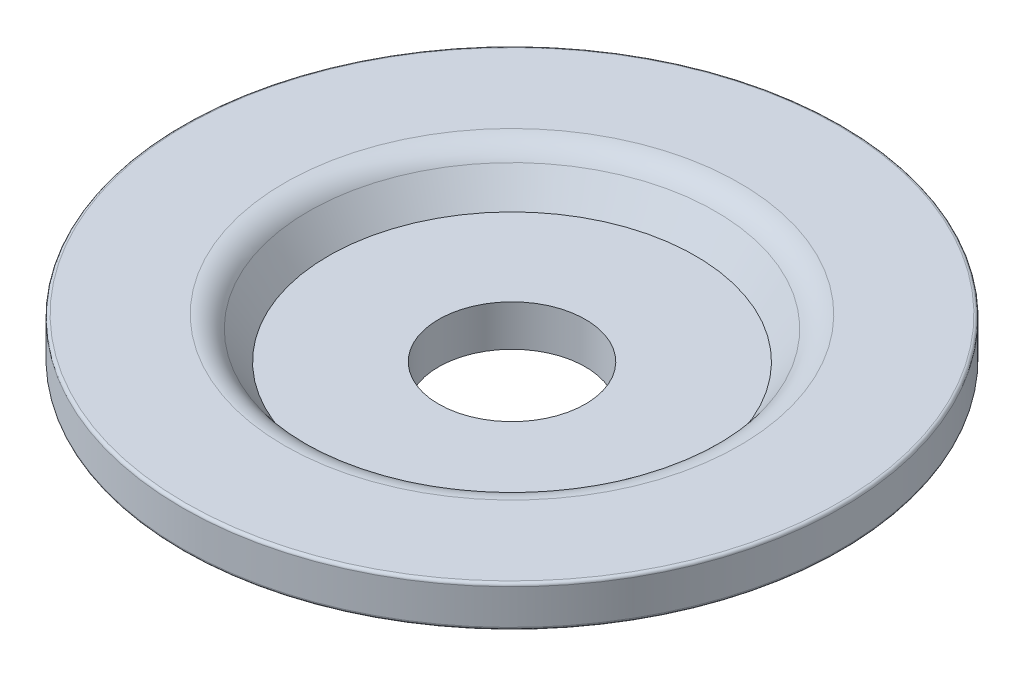
ISO-10303-21;
HEADER;
FILE_DESCRIPTION(('STEP AP214'),'2;1');
FILE_NAME('part.step','',(''),(''),'','','');
FILE_SCHEMA(('AUTOMOTIVE_DESIGN { 1 0 10303 214 1 1 1 1 }'));
ENDSEC;
DATA;
#1=APPLICATION_CONTEXT('core data for automotive mechanical design processes');
#2=APPLICATION_PROTOCOL_DEFINITION('international standard','automotive_design',2000,#1);
#3=PRODUCT_CONTEXT('',#1,'mechanical');
#4=PRODUCT('Part','Part','',(#3));
#5=PRODUCT_RELATED_PRODUCT_CATEGORY('part','',(#4));
#6=PRODUCT_DEFINITION_FORMATION('','',#4);
#7=PRODUCT_DEFINITION_CONTEXT('part definition',#1,'design');
#8=PRODUCT_DEFINITION('design','',#6,#7);
#9=PRODUCT_DEFINITION_SHAPE('','',#8);
#10=(LENGTH_UNIT() NAMED_UNIT(*) SI_UNIT(.MILLI.,.METRE.));
#11=(NAMED_UNIT(*) PLANE_ANGLE_UNIT() SI_UNIT($,.RADIAN.));
#12=(NAMED_UNIT(*) SI_UNIT($,.STERADIAN.) SOLID_ANGLE_UNIT());
#13=UNCERTAINTY_MEASURE_WITH_UNIT(LENGTH_MEASURE(1.E-05),#10,'distance_accuracy_value','');
#14=(GEOMETRIC_REPRESENTATION_CONTEXT(3) GLOBAL_UNCERTAINTY_ASSIGNED_CONTEXT((#13)) GLOBAL_UNIT_ASSIGNED_CONTEXT((#10,
#11,#12)) REPRESENTATION_CONTEXT('',''));
#15=CARTESIAN_POINT('',(0.,0.,0.));
#16=DIRECTION('',(0.,0.,1.));
#17=DIRECTION('',(1.,0.,0.));
#18=AXIS2_PLACEMENT_3D('',#15,#16,#17);
#19=CARTESIAN_POINT('',(0.,0.973091831143438,0.));
#20=DIRECTION('',(0.,1.,0.));
#21=DIRECTION('',(0.,0.,1.));
#22=AXIS2_PLACEMENT_3D('',#19,#20,#21);
#23=CONICAL_SURFACE('',#22,6.93050884502841,0.610273766920193);
#24=CARTESIAN_POINT('',(0.,0.,0.));
#25=DIRECTION('',(0.,1.,0.));
#26=DIRECTION('',(0.,0.,1.));
#27=AXIS2_PLACEMENT_3D('',#24,#25,#26);
#28=CIRCLE('',#27,6.25);
#29=CARTESIAN_POINT('',(0.,0.,6.25));
#30=VERTEX_POINT('',#29);
#31=EDGE_CURVE('E74',#30,#30,#28,.T.);
#32=ORIENTED_EDGE('',*,*,#31,.F.);
#33=EDGE_LOOP('',(#32));
#34=FACE_BOUND('',#33,.T.);
#35=CARTESIAN_POINT('',(0.,0.973091831143438,0.));
#36=DIRECTION('',(0.,1.,0.));
#37=DIRECTION('',(0.,0.,1.));
#38=AXIS2_PLACEMENT_3D('',#35,#36,#37);
#39=CIRCLE('',#38,6.93050884502841);
#40=CARTESIAN_POINT('',(0.,0.973091831143438,6.93050884502841));
#41=VERTEX_POINT('',#40);
#42=EDGE_CURVE('E10',#41,#41,#39,.T.);
#43=ORIENTED_EDGE('',*,*,#42,.T.);
#44=EDGE_LOOP('',(#43));
#45=FACE_BOUND('',#44,.T.);
#46=ADVANCED_FACE('F34',(#34,#45),#23,.F.);
#47=CARTESIAN_POINT('',(0.,0.4,0.));
#48=DIRECTION('',(0.,1.,0.));
#49=DIRECTION('',(0.,0.,1.));
#50=AXIS2_PLACEMENT_3D('',#47,#48,#49);
#51=TOROIDAL_SURFACE('',#50,7.74999999999999,0.999999999999999);
#52=ORIENTED_EDGE('',*,*,#42,.F.);
#53=EDGE_LOOP('',(#52));
#54=FACE_BOUND('',#53,.T.);
#55=CARTESIAN_POINT('',(0.,1.4,0.));
#56=DIRECTION('',(0.,1.,0.));
#57=DIRECTION('',(0.,0.,1.));
#58=AXIS2_PLACEMENT_3D('',#55,#56,#57);
#59=CIRCLE('',#58,7.74999999999999);
#60=CARTESIAN_POINT('',(0.,1.4,7.74999999999999));
#61=VERTEX_POINT('',#60);
#62=EDGE_CURVE('E40',#61,#61,#59,.T.);
#63=ORIENTED_EDGE('',*,*,#62,.T.);
#64=EDGE_LOOP('',(#63));
#65=FACE_BOUND('',#64,.T.);
#66=ADVANCED_FACE('F81',(#54,#65),#51,.T.);
#67=CARTESIAN_POINT('',(7.74999999999999,1.4,0.));
#68=DIRECTION('',(0.,-1.,0.));
#69=DIRECTION('',(0.,0.,-1.));
#70=AXIS2_PLACEMENT_3D('',#67,#68,#69);
#71=PLANE('',#70);
#72=ORIENTED_EDGE('',*,*,#62,.F.);
#73=EDGE_LOOP('',(#72));
#74=FACE_BOUND('',#73,.T.);
#75=CARTESIAN_POINT('',(0.,1.4,0.));
#76=DIRECTION('',(0.,1.,0.));
#77=DIRECTION('',(0.,0.,1.));
#78=AXIS2_PLACEMENT_3D('',#75,#76,#77);
#79=CIRCLE('',#78,11.125);
#80=CARTESIAN_POINT('',(0.,1.4,11.125));
#81=VERTEX_POINT('',#80);
#82=EDGE_CURVE('E44',#81,#81,#79,.T.);
#83=ORIENTED_EDGE('',*,*,#82,.T.);
#84=EDGE_LOOP('',(#83));
#85=FACE_BOUND('',#84,.T.);
#86=ADVANCED_FACE('F85',(#74,#85),#71,.F.);
#87=CARTESIAN_POINT('',(0.,1.3,0.));
#88=DIRECTION('',(0.,1.,0.));
#89=DIRECTION('',(0.,0.,1.));
#90=AXIS2_PLACEMENT_3D('',#87,#88,#89);
#91=TOROIDAL_SURFACE('',#90,11.125,0.0999999999999996);
#92=ORIENTED_EDGE('',*,*,#82,.F.);
#93=EDGE_LOOP('',(#92));
#94=FACE_BOUND('',#93,.T.);
#95=CARTESIAN_POINT('',(0.,1.3,0.));
#96=DIRECTION('',(0.,1.,0.));
#97=DIRECTION('',(0.,0.,1.));
#98=AXIS2_PLACEMENT_3D('',#95,#96,#97);
#99=CIRCLE('',#98,11.225);
#100=CARTESIAN_POINT('',(0.,1.3,11.225));
#101=VERTEX_POINT('',#100);
#102=EDGE_CURVE('E48',#101,#101,#99,.T.);
#103=ORIENTED_EDGE('',*,*,#102,.T.);
#104=EDGE_LOOP('',(#103));
#105=FACE_BOUND('',#104,.T.);
#106=ADVANCED_FACE('F90',(#94,#105),#91,.T.);
#107=CARTESIAN_POINT('',(0.,11.5390643922792,0.));
#108=DIRECTION('',(0.,1.,0.));
#109=DIRECTION('',(0.,0.,1.));
#110=AXIS2_PLACEMENT_3D('',#107,#108,#109);
#111=CYLINDRICAL_SURFACE('',#110,11.225);
#112=ORIENTED_EDGE('',*,*,#102,.F.);
#113=EDGE_LOOP('',(#112));
#114=FACE_BOUND('',#113,.T.);
#115=CARTESIAN_POINT('',(0.,0.0999999999999994,0.));
#116=DIRECTION('',(0.,1.,0.));
#117=DIRECTION('',(0.,0.,1.));
#118=AXIS2_PLACEMENT_3D('',#115,#116,#117);
#119=CIRCLE('',#118,11.225);
#120=CARTESIAN_POINT('',(0.,0.0999999999999994,11.225));
#121=VERTEX_POINT('',#120);
#122=EDGE_CURVE('E53',#121,#121,#119,.T.);
#123=ORIENTED_EDGE('',*,*,#122,.T.);
#124=EDGE_LOOP('',(#123));
#125=FACE_BOUND('',#124,.T.);
#126=ADVANCED_FACE('F96',(#114,#125),#111,.T.);
#127=CARTESIAN_POINT('',(0.,0.1,0.));
#128=DIRECTION('',(0.,1.,0.));
#129=DIRECTION('',(0.,0.,1.));
#130=AXIS2_PLACEMENT_3D('',#127,#128,#129);
#131=TOROIDAL_SURFACE('',#130,11.125,0.0999999999999988);
#132=ORIENTED_EDGE('',*,*,#122,.F.);
#133=EDGE_LOOP('',(#132));
#134=FACE_BOUND('',#133,.T.);
#135=CARTESIAN_POINT('',(0.,0.,0.));
#136=DIRECTION('',(0.,1.,0.));
#137=DIRECTION('',(0.,0.,1.));
#138=AXIS2_PLACEMENT_3D('',#135,#136,#137);
#139=CIRCLE('',#138,11.125);
#140=CARTESIAN_POINT('',(0.,0.,11.125));
#141=VERTEX_POINT('',#140);
#142=EDGE_CURVE('E56',#141,#141,#139,.T.);
#143=ORIENTED_EDGE('',*,*,#142,.T.);
#144=EDGE_LOOP('',(#143));
#145=FACE_BOUND('',#144,.T.);
#146=ADVANCED_FACE('F100',(#134,#145),#131,.T.);
#147=CARTESIAN_POINT('',(7.95837719419747,0.,0.));
#148=DIRECTION('',(0.,1.,0.));
#149=DIRECTION('',(0.,0.,1.));
#150=AXIS2_PLACEMENT_3D('',#147,#148,#149);
#151=PLANE('',#150);
#152=ORIENTED_EDGE('',*,*,#142,.F.);
#153=EDGE_LOOP('',(#152));
#154=FACE_BOUND('',#153,.T.);
#155=CARTESIAN_POINT('',(0.,0.,0.));
#156=DIRECTION('',(0.,1.,0.));
#157=DIRECTION('',(0.,0.,1.));
#158=AXIS2_PLACEMENT_3D('',#155,#156,#157);
#159=CIRCLE('',#158,7.95837719419747);
#160=CARTESIAN_POINT('',(0.,0.,7.95837719419747));
#161=VERTEX_POINT('',#160);
#162=EDGE_CURVE('E59',#161,#161,#159,.T.);
#163=ORIENTED_EDGE('',*,*,#162,.T.);
#164=EDGE_LOOP('',(#163));
#165=FACE_BOUND('',#164,.T.);
#166=ADVANCED_FACE('F104',(#154,#165),#151,.F.);
#167=CARTESIAN_POINT('',(0.,-0.759637746715157,0.));
#168=DIRECTION('',(0.,1.,0.));
#169=DIRECTION('',(0.,0.,1.));
#170=AXIS2_PLACEMENT_3D('',#167,#168,#169);
#171=CONICAL_SURFACE('',#170,7.427142433908,0.610273766920194);
#172=ORIENTED_EDGE('',*,*,#162,.F.);
#173=EDGE_LOOP('',(#172));
#174=FACE_BOUND('',#173,.T.);
#175=CARTESIAN_POINT('',(0.,-0.759637746715157,0.));
#176=DIRECTION('',(0.,1.,0.));
#177=DIRECTION('',(0.,0.,1.));
#178=AXIS2_PLACEMENT_3D('',#175,#176,#177);
#179=CIRCLE('',#178,7.427142433908);
#180=CARTESIAN_POINT('',(0.,-0.759637746715157,7.427142433908));
#181=VERTEX_POINT('',#180);
#182=EDGE_CURVE('E62',#181,#181,#179,.T.);
#183=ORIENTED_EDGE('',*,*,#182,.T.);
#184=EDGE_LOOP('',(#183));
#185=FACE_BOUND('',#184,.T.);
#186=ADVANCED_FACE('F108',(#174,#185),#171,.T.);
#187=CARTESIAN_POINT('',(0.,0.1,0.));
#188=DIRECTION('',(0.,1.,0.));
#189=DIRECTION('',(0.,0.,1.));
#190=AXIS2_PLACEMENT_3D('',#187,#188,#189);
#191=TOROIDAL_SURFACE('',#190,6.19790570145063,1.5);
#192=ORIENTED_EDGE('',*,*,#182,.F.);
#193=EDGE_LOOP('',(#192));
#194=FACE_BOUND('',#193,.T.);
#195=CARTESIAN_POINT('',(0.,-1.4,0.));
#196=DIRECTION('',(0.,1.,0.));
#197=DIRECTION('',(0.,0.,1.));
#198=AXIS2_PLACEMENT_3D('',#195,#196,#197);
#199=CIRCLE('',#198,6.19790570145063);
#200=CARTESIAN_POINT('',(0.,-1.4,6.19790570145063));
#201=VERTEX_POINT('',#200);
#202=EDGE_CURVE('E65',#201,#201,#199,.T.);
#203=ORIENTED_EDGE('',*,*,#202,.T.);
#204=EDGE_LOOP('',(#203));
#205=FACE_BOUND('',#204,.T.);
#206=ADVANCED_FACE('F112',(#194,#205),#191,.T.);
#207=CARTESIAN_POINT('',(2.5,-1.4,0.));
#208=DIRECTION('',(0.,1.,0.));
#209=DIRECTION('',(0.,0.,1.));
#210=AXIS2_PLACEMENT_3D('',#207,#208,#209);
#211=PLANE('',#210);
#212=ORIENTED_EDGE('',*,*,#202,.F.);
#213=EDGE_LOOP('',(#212));
#214=FACE_BOUND('',#213,.T.);
#215=CARTESIAN_POINT('',(0.,-1.4,0.));
#216=DIRECTION('',(0.,1.,0.));
#217=DIRECTION('',(0.,0.,1.));
#218=AXIS2_PLACEMENT_3D('',#215,#216,#217);
#219=CIRCLE('',#218,2.5);
#220=CARTESIAN_POINT('',(0.,-1.4,2.5));
#221=VERTEX_POINT('',#220);
#222=EDGE_CURVE('E68',#221,#221,#219,.T.);
#223=ORIENTED_EDGE('',*,*,#222,.T.);
#224=EDGE_LOOP('',(#223));
#225=FACE_BOUND('',#224,.T.);
#226=ADVANCED_FACE('F116',(#214,#225),#211,.F.);
#227=CARTESIAN_POINT('',(0.,11.5390643922792,0.));
#228=DIRECTION('',(0.,1.,0.));
#229=DIRECTION('',(0.,0.,1.));
#230=AXIS2_PLACEMENT_3D('',#227,#228,#229);
#231=CYLINDRICAL_SURFACE('',#230,2.5);
#232=ORIENTED_EDGE('',*,*,#222,.F.);
#233=EDGE_LOOP('',(#232));
#234=FACE_BOUND('',#233,.T.);
#235=CARTESIAN_POINT('',(0.,0.,0.));
#236=DIRECTION('',(0.,1.,0.));
#237=DIRECTION('',(0.,0.,1.));
#238=AXIS2_PLACEMENT_3D('',#235,#236,#237);
#239=CIRCLE('',#238,2.5);
#240=CARTESIAN_POINT('',(0.,0.,2.5));
#241=VERTEX_POINT('',#240);
#242=EDGE_CURVE('E71',#241,#241,#239,.T.);
#243=ORIENTED_EDGE('',*,*,#242,.T.);
#244=EDGE_LOOP('',(#243));
#245=FACE_BOUND('',#244,.T.);
#246=ADVANCED_FACE('F120',(#234,#245),#231,.F.);
#247=CARTESIAN_POINT('',(2.5,0.,0.));
#248=DIRECTION('',(0.,-1.,0.));
#249=DIRECTION('',(0.,0.,-1.));
#250=AXIS2_PLACEMENT_3D('',#247,#248,#249);
#251=PLANE('',#250);
#252=ORIENTED_EDGE('',*,*,#242,.F.);
#253=EDGE_LOOP('',(#252));
#254=FACE_BOUND('',#253,.T.);
#255=ORIENTED_EDGE('',*,*,#31,.T.);
#256=EDGE_LOOP('',(#255));
#257=FACE_BOUND('',#256,.T.);
#258=ADVANCED_FACE('F78',(#254,#257),#251,.F.);
#259=CLOSED_SHELL('',(#46,#66,#86,#106,#126,#146,#166,#186,#206,#226,#246,#258));
#260=MANIFOLD_SOLID_BREP('B2',#259);
#261=ADVANCED_BREP_SHAPE_REPRESENTATION('',(#18,#260),#14);
#262=SHAPE_DEFINITION_REPRESENTATION(#9,#261);
ENDSEC;
END-ISO-10303-21;
